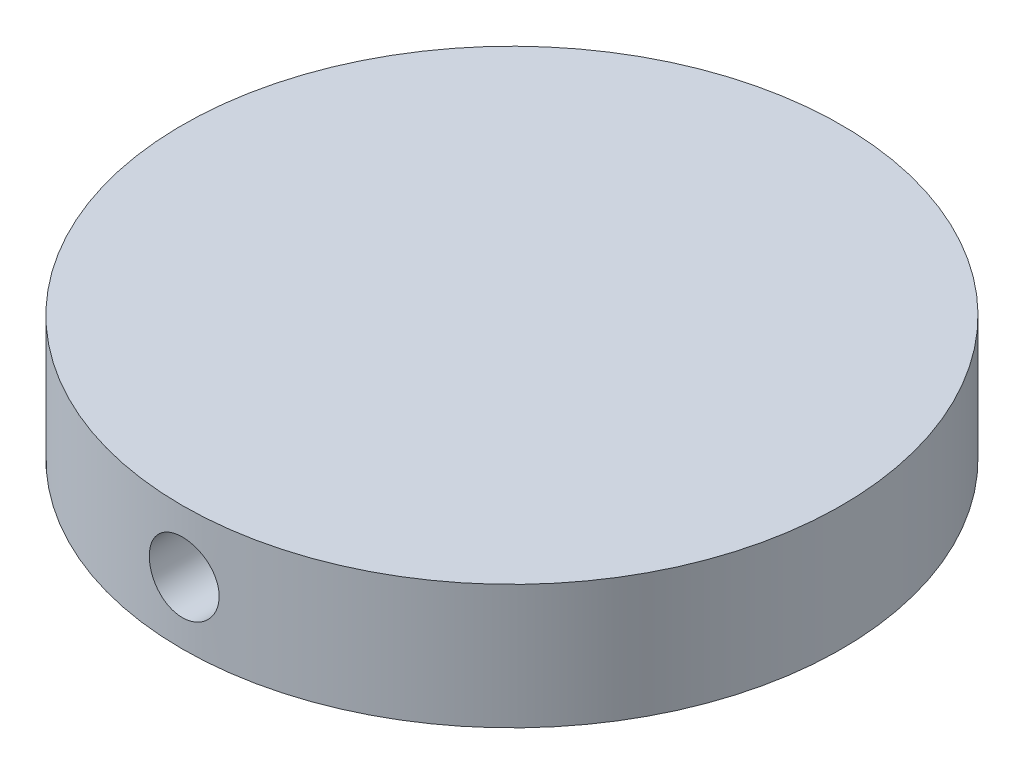
ISO-10303-21;
HEADER;
FILE_DESCRIPTION(('STEP AP214'),'2;1');
FILE_NAME('part.step','',(''),(''),'','','');
FILE_SCHEMA(('AUTOMOTIVE_DESIGN { 1 0 10303 214 1 1 1 1 }'));
ENDSEC;
DATA;
#1=APPLICATION_CONTEXT('core data for automotive mechanical design processes');
#2=APPLICATION_PROTOCOL_DEFINITION('international standard','automotive_design',2000,#1);
#3=PRODUCT_CONTEXT('',#1,'mechanical');
#4=PRODUCT('Part','Part','',(#3));
#5=PRODUCT_RELATED_PRODUCT_CATEGORY('part','',(#4));
#6=PRODUCT_DEFINITION_FORMATION('','',#4);
#7=PRODUCT_DEFINITION_CONTEXT('part definition',#1,'design');
#8=PRODUCT_DEFINITION('design','',#6,#7);
#9=PRODUCT_DEFINITION_SHAPE('','',#8);
#10=(LENGTH_UNIT() NAMED_UNIT(*) SI_UNIT(.MILLI.,.METRE.));
#11=(NAMED_UNIT(*) PLANE_ANGLE_UNIT() SI_UNIT($,.RADIAN.));
#12=(NAMED_UNIT(*) SI_UNIT($,.STERADIAN.) SOLID_ANGLE_UNIT());
#13=UNCERTAINTY_MEASURE_WITH_UNIT(LENGTH_MEASURE(1.E-05),#10,'distance_accuracy_value','');
#14=(GEOMETRIC_REPRESENTATION_CONTEXT(3) GLOBAL_UNCERTAINTY_ASSIGNED_CONTEXT((#13)) GLOBAL_UNIT_ASSIGNED_CONTEXT((#10,
#11,#12)) REPRESENTATION_CONTEXT('',''));
#15=CARTESIAN_POINT('',(0.,0.,0.));
#16=DIRECTION('',(0.,0.,1.));
#17=DIRECTION('',(1.,0.,0.));
#18=AXIS2_PLACEMENT_3D('',#15,#16,#17);
#19=CARTESIAN_POINT('',(0.,10.16,0.));
#20=DIRECTION('',(0.,-1.,0.));
#21=DIRECTION('',(0.,0.,-1.));
#22=AXIS2_PLACEMENT_3D('',#19,#20,#21);
#23=CYLINDRICAL_SURFACE('',#22,26.9426943892076);
#24=CARTESIAN_POINT('',(0.,7.93484678348048,-26.9426943892076));
#25=CARTESIAN_POINT('',(-0.159877159383876,7.93483988643036,-26.9426924517004));
#26=CARTESIAN_POINT('',(-0.319858758329828,7.92137138815957,-26.9412562283668));
#27=CARTESIAN_POINT('',(-0.635383052913121,7.86784825567092,-26.935664962776));
#28=CARTESIAN_POINT('',(-0.790920721198874,7.82776466481908,-26.931506959352));
#29=CARTESIAN_POINT('',(-1.09294263287596,7.72219447357253,-26.9209412920244));
#30=CARTESIAN_POINT('',(-1.23943241672469,7.65672360146154,-26.9145350212319));
#31=CARTESIAN_POINT('',(-1.51931297800012,7.5022687444642,-26.9001883139086));
#32=CARTESIAN_POINT('',(-1.65270627477424,7.41328929408403,-26.8922481733212));
#33=CARTESIAN_POINT('',(-1.90317412259161,7.2139599202933,-26.8756868697374));
#34=CARTESIAN_POINT('',(-2.02018862977533,7.10353473526227,-26.8670633735842));
#35=CARTESIAN_POINT('',(-2.23406095927334,6.86460930912446,-26.8501264660232));
#36=CARTESIAN_POINT('',(-2.33091782946652,6.73610821470463,-26.8418130692779));
#37=CARTESIAN_POINT('',(-2.5019408490585,6.46429928462084,-26.8264140392329));
#38=CARTESIAN_POINT('',(-2.57605219614729,6.32095678368136,-26.819331388773));
#39=CARTESIAN_POINT('',(-2.69913049228707,6.02377391650471,-26.8072251987603));
#40=CARTESIAN_POINT('',(-2.7480981344032,5.86993383975684,-26.8022016024522));
#41=CARTESIAN_POINT('',(-2.81931989738946,5.5567379633049,-26.7948037259853));
#42=CARTESIAN_POINT('',(-2.84167407108998,5.39740515422929,-26.7924195254556));
#43=CARTESIAN_POINT('',(-2.85934369682739,5.07723279416105,-26.7905397084476));
#44=CARTESIAN_POINT('',(-2.85465994146592,4.9163932874744,-26.7910440072944));
#45=CARTESIAN_POINT('',(-2.81846905343392,4.59846451776627,-26.794875143979));
#46=CARTESIAN_POINT('',(-2.78707137409505,4.44136263695995,-26.7981904641992));
#47=CARTESIAN_POINT('',(-2.6985143121884,4.13467072605792,-26.8072521094579));
#48=CARTESIAN_POINT('',(-2.64135454327105,3.98508080865519,-26.8129984709541));
#49=CARTESIAN_POINT('',(-2.50277573804035,3.69731462599618,-26.8262879464804));
#50=CARTESIAN_POINT('',(-2.42130835947024,3.55916181257801,-26.8338346348949));
#51=CARTESIAN_POINT('',(-2.23646159610886,3.29844819385414,-26.84987148588));
#52=CARTESIAN_POINT('',(-2.13308149091401,3.17588790138075,-26.8583616794649));
#53=CARTESIAN_POINT('',(-1.90673356485588,2.94920248878122,-26.8753802163619));
#54=CARTESIAN_POINT('',(-1.78367125697851,2.84517169024334,-26.8839085403335));
#55=CARTESIAN_POINT('',(-1.5217797010617,2.65923011053586,-26.9000027880204));
#56=CARTESIAN_POINT('',(-1.3829504318825,2.57731935902451,-26.9075687104454));
#57=CARTESIAN_POINT('',(-1.09339884192997,2.43794596333726,-26.9208886152643));
#58=CARTESIAN_POINT('',(-0.942674081742448,2.38048834930217,-26.9266422247925));
#59=CARTESIAN_POINT('',(-0.633641927096003,2.29172261785325,-26.9356855344664));
#60=CARTESIAN_POINT('',(-0.475334787509801,2.26041362213585,-26.9389753173689));
#61=CARTESIAN_POINT('',(-0.156448178430623,2.2249540984177,-26.9427096481539));
#62=CARTESIAN_POINT('',(0.0041166703529047,2.22067346311087,-26.9431678263981));
#63=CARTESIAN_POINT('',(0.323677590728516,2.23905009174925,-26.941223927833));
#64=CARTESIAN_POINT('',(0.482673686128314,2.26170694624974,-26.9388218944983));
#65=CARTESIAN_POINT('',(0.794206426753189,2.33320743550273,-26.9314361431082));
#66=CARTESIAN_POINT('',(0.946757264920026,2.38198990632225,-26.9264584559561));
#67=CARTESIAN_POINT('',(1.24151092739237,2.50429385679205,-26.9144795571014));
#68=CARTESIAN_POINT('',(1.38371349281771,2.57781595508887,-26.9074782947972));
#69=CARTESIAN_POINT('',(1.65432069634103,2.74783307987966,-26.8922008169085));
#70=CARTESIAN_POINT('',(1.78267153947844,2.84441330090572,-26.8839199143451));
#71=CARTESIAN_POINT('',(2.02138674359008,3.05768331741806,-26.8670267228596));
#72=CARTESIAN_POINT('',(2.13175059638013,3.17437368088214,-26.8584144245829));
#73=CARTESIAN_POINT('',(2.3318129132522,3.4251204794829,-26.8417878562375));
#74=CARTESIAN_POINT('',(2.42142579706549,3.55924539047159,-26.8337761517756));
#75=CARTESIAN_POINT('',(2.57685344767387,3.84071743219922,-26.8192976503929));
#76=CARTESIAN_POINT('',(2.64266857413196,3.98806436306761,-26.8128308301243));
#77=CARTESIAN_POINT('',(2.74849021362492,4.29150811747201,-26.8021906718622));
#78=CARTESIAN_POINT('',(2.7885470613092,4.44758722422036,-26.7980128632553));
#79=CARTESIAN_POINT('',(2.841878144485,4.7643027448899,-26.792410123055));
#80=CARTESIAN_POINT('',(2.85515325118819,4.92493901039403,-26.7909851019133));
#81=CARTESIAN_POINT('',(2.85453108497236,5.24535822720242,-26.791051333817));
#82=CARTESIAN_POINT('',(2.84076824523251,5.40514145945294,-26.7925281588352));
#83=CARTESIAN_POINT('',(2.78674334556824,5.72011183580245,-26.7982008634174));
#84=CARTESIAN_POINT('',(2.74648126091114,5.87529897561162,-26.8023967455192));
#85=CARTESIAN_POINT('',(2.64063897718774,6.17666724216665,-26.813030692379));
#86=CARTESIAN_POINT('',(2.57506329208913,6.32284996920978,-26.8194683573582));
#87=CARTESIAN_POINT('',(2.42046889655287,6.60215613943396,-26.8338612876177));
#88=CARTESIAN_POINT('',(2.33145022344948,6.73527960341214,-26.8418165504812));
#89=CARTESIAN_POINT('',(2.13199292023992,6.98537715048829,-26.8583957308812));
#90=CARTESIAN_POINT('',(2.02145404173616,7.10227108687087,-26.867022659795));
#91=CARTESIAN_POINT('',(1.78229603411016,7.31590763047929,-26.883945788664));
#92=CARTESIAN_POINT('',(1.65367259667136,7.41264542220147,-26.8922419092039));
#93=CARTESIAN_POINT('',(1.38159859335583,7.5834407726981,-26.9075931525462));
#94=CARTESIAN_POINT('',(1.23810765795318,7.65743429557786,-26.9146447481081));
#95=CARTESIAN_POINT('',(0.940751967813219,7.78017609682314,-26.9266748377104));
#96=CARTESIAN_POINT('',(0.786899036468111,7.82895261500818,-26.9316556495336));
#97=CARTESIAN_POINT('',(0.526825651007194,7.88781883613497,-26.9377424666804));
#98=CARTESIAN_POINT('',(0.422263189413774,7.90542995162689,-26.9395906945645));
#99=CARTESIAN_POINT('',(0.211815764247985,7.92894618228599,-26.9420672947914));
#100=CARTESIAN_POINT('',(0.105930806987645,7.93485135330201,-26.9426956729539));
#101=CARTESIAN_POINT('',(0.,7.93484678348048,-26.9426943892076));
#102=B_SPLINE_CURVE_WITH_KNOTS('',3,(#24,#25,#26,#27,#28,#29,#30,#31,#32,#33,#34,#35,#36,#37,
#38,#39,#40,#41,#42,#43,#44,#45,#46,#47,#48,#49,#50,#51,#52,#53,#54,#55,#56,#57,#58,#59,#60,#61,
#62,#63,#64,#65,#66,#67,#68,#69,#70,#71,#72,#73,#74,#75,#76,#77,#78,#79,#80,#81,#82,#83,#84,#85,
#86,#87,#88,#89,#90,#91,#92,#93,#94,#95,#96,#97,#98,#99,#100,#101),.UNSPECIFIED.,.T.,.F.,(4,2,2,
2,2,2,2,2,2,2,2,2,2,2,2,2,2,2,2,2,2,2,2,2,2,2,2,2,2,2,2,2,2,2,2,2,2,2,4),(0.,0.479244634675585,
0.959011533173834,1.43848167343976,1.91785939743963,2.39895088275477,2.88006508667779,
3.36232953237574,3.84458068414511,4.32501303830536,4.80543130893376,5.28389061793137,
5.76235710253872,6.24178156266498,6.7212217868121,7.20303681270819,7.68485248461164,
8.16676722071906,8.64866576918507,9.12824280698233,9.60781255539319,10.0862644369199,
10.564728283647,11.0449880760369,11.5252614347958,12.0074815758749,12.4896944287048,
12.9709620952267,13.4522141058297,13.9310793776005,14.4099450963137,14.8887254622305,
15.3675050656676,15.8485707901386,16.32975131455,16.8122744368203,17.2942560179899,
17.6117936406273,17.9293297482947),.UNSPECIFIED.);
#103=CARTESIAN_POINT('',(0.,7.93484678348048,-26.9426943892076));
#104=VERTEX_POINT('',#103);
#105=EDGE_CURVE('E10',#104,#104,#102,.T.);
#106=ORIENTED_EDGE('',*,*,#105,.T.);
#107=EDGE_LOOP('',(#106));
#108=FACE_BOUND('',#107,.T.);
#109=CARTESIAN_POINT('',(2.85484678348048,5.08,26.7910177259673));
#110=CARTESIAN_POINT('',(2.85483988389814,4.92012568123884,26.7910197041622));
#111=CARTESIAN_POINT('',(2.84137184805784,4.7601469141133,26.7924642195504));
#112=CARTESIAN_POINT('',(2.78785071932311,4.44462850317713,26.7980851061099));
#113=CARTESIAN_POINT('',(2.74776865992525,4.28909388894578,26.8022644537802));
#114=CARTESIAN_POINT('',(2.64220294850322,3.98707843559701,26.8128764103614));
#115=CARTESIAN_POINT('',(2.57673509753405,3.84059203016363,26.8193076173908));
#116=CARTESIAN_POINT('',(2.42228735550066,3.5607171314871,26.8336969427398));
#117=CARTESIAN_POINT('',(2.33331199154483,3.42732612309169,26.8416547669807));
#118=CARTESIAN_POINT('',(2.13398674884937,3.17685569884867,26.8582369059445));
#119=CARTESIAN_POINT('',(2.02356069523453,3.05983704988936,26.8668635280554));
#120=CARTESIAN_POINT('',(1.7846317918789,2.84595672452549,26.8837903637851));
#121=CARTESIAN_POINT('',(1.65612810013852,2.74909598753442,26.892090562177));
#122=CARTESIAN_POINT('',(1.38431688681535,2.57806891842799,26.90745235457));
#123=CARTESIAN_POINT('',(1.24097514665537,2.50395668010404,26.9145109794833));
#124=CARTESIAN_POINT('',(0.943793932793908,2.38087652649759,26.9265691348402));
#125=CARTESIAN_POINT('',(0.789954744190559,2.33190792865161,26.9315687211789));
#126=CARTESIAN_POINT('',(0.476761617403015,2.26068417744013,26.9389292708106));
#127=CARTESIAN_POINT('',(0.31743068818355,2.23832888465075,26.9413001230663));
#128=CARTESIAN_POINT('',(-0.00273798890655452,2.22065636938549,26.9431697389119));
#129=CARTESIAN_POINT('',(-0.163575693150743,2.22533836648543,26.9426685854014));
#130=CARTESIAN_POINT('',(-0.481512201908553,2.26152646514839,26.9388587290631));
#131=CARTESIAN_POINT('',(-0.638623417067487,2.2929248835038,26.9355612970948));
#132=CARTESIAN_POINT('',(-0.94533361490643,2.38148665676935,26.9265423001963));
#133=CARTESIAN_POINT('',(-1.094932489791,2.43865038127151,26.9208207004925));
#134=CARTESIAN_POINT('',(-1.38270955267683,2.57723738834138,26.9075771382247));
#135=CARTESIAN_POINT('',(-1.52086473540974,2.65870809216498,26.9000516621152));
#136=CARTESIAN_POINT('',(-1.78158168363497,2.84356195880917,26.8840442349329));
#137=CARTESIAN_POINT('',(-1.90414293510587,2.94694584365277,26.8755622523482));
#138=CARTESIAN_POINT('',(-2.13082409941682,3.17329645755509,26.8585439133967));
#139=CARTESIAN_POINT('',(-2.23485045320336,3.29635690020434,26.8500074946236));
#140=CARTESIAN_POINT('',(-2.42078395275651,3.55824313812095,26.833883870498));
#141=CARTESIAN_POINT('',(-2.5026910596202,3.69706896111557,26.8262966668151));
#142=CARTESIAN_POINT('',(-2.642061830764,3.98661960319734,26.8129300381883));
#143=CARTESIAN_POINT('',(-2.69951934188553,4.13734740631932,26.8071510684142));
#144=CARTESIAN_POINT('',(-2.78828393568845,4.4463861773084,26.7980645269877));
#145=CARTESIAN_POINT('',(-2.81959191522391,4.60469688490665,26.7947568705767));
#146=CARTESIAN_POINT('',(-2.85504760440086,4.92358517635758,26.7910023390565));
#147=CARTESIAN_POINT('',(-2.85932637241224,5.08414803243837,26.7905416598524));
#148=CARTESIAN_POINT('',(-2.84094672042313,5.40370451934607,26.7924967993199));
#149=CARTESIAN_POINT('',(-2.81828870996806,5.56269817399397,26.7949125742582));
#150=CARTESIAN_POINT('',(-2.74678848347511,5.87421865848104,26.8023358598888));
#151=CARTESIAN_POINT('',(-2.69800856223978,6.02675994575399,26.8073372036112));
#152=CARTESIAN_POINT('',(-2.57571290813547,6.3214956338309,26.8193631021633));
#153=CARTESIAN_POINT('',(-2.50219654155663,6.46368976944317,26.8263877088251));
#154=CARTESIAN_POINT('',(-2.33218787464845,6.73429119102948,26.8417019815438));
#155=CARTESIAN_POINT('',(-2.2356089241447,6.86264376621816,26.8499963751835));
#156=CARTESIAN_POINT('',(-2.02234043224916,7.10136305646955,26.8669003249733));
#157=CARTESIAN_POINT('',(-1.90565033137473,7.21172927099401,26.8755098898861));
#158=CARTESIAN_POINT('',(-1.65490250976746,7.4117967460015,26.8921159390344));
#159=CARTESIAN_POINT('',(-1.52077626495283,7.50141237286178,26.9001097949485));
#160=CARTESIAN_POINT('',(-1.23930081892112,7.65684483537649,26.9145452564537));
#161=CARTESIAN_POINT('',(-1.09195181810536,7.72266203163899,26.9209868855647));
#162=CARTESIAN_POINT('',(-0.788509326048759,7.82848502808786,26.9315802756683));
#163=CARTESIAN_POINT('',(-0.632433866442129,7.86854205984484,26.9357365792914));
#164=CARTESIAN_POINT('',(-0.315726042104914,7.92187474679885,26.9413097075169));
#165=CARTESIAN_POINT('',(-0.155093822453134,7.93515125366994,26.9427266192374));
#166=CARTESIAN_POINT('',(0.165327754631512,7.93453319493961,26.9426611928439));
#167=CARTESIAN_POINT('',(0.325117387508638,7.92077136746343,26.9411930183525));
#168=CARTESIAN_POINT('',(0.640100819195297,7.86674624175336,26.9355503651846));
#169=CARTESIAN_POINT('',(0.795294615670551,7.82648293005929,26.9313758851336));
#170=CARTESIAN_POINT('',(1.09667630769143,7.72063565542683,26.9207881365634));
#171=CARTESIAN_POINT('',(1.2428657776629,7.65505613373928,26.9143752607473));
#172=CARTESIAN_POINT('',(1.52218383439756,7.50045197569658,26.9000245264412));
#173=CARTESIAN_POINT('',(1.6553124461425,7.41142738418645,26.8920866708681));
#174=CARTESIAN_POINT('',(1.90540975951221,7.21196354366497,26.8755279478503));
#175=CARTESIAN_POINT('',(2.02229939054917,7.10142540173502,26.8669040393715));
#176=CARTESIAN_POINT('',(2.23592759154584,6.86227064255722,26.849970653667));
#177=CARTESIAN_POINT('',(2.33266133468214,6.73364970726131,26.8416612521466));
#178=CARTESIAN_POINT('',(2.50345229560147,6.46157777047998,26.8262726465109));
#179=CARTESIAN_POINT('',(2.57744475870302,6.31808594820719,26.8191969797005));
#180=CARTESIAN_POINT('',(2.70018433345021,6.02072838269013,26.8071189004901));
#181=CARTESIAN_POINT('',(2.74895969891465,5.86687446887208,26.8021141690273));
#182=CARTESIAN_POINT('',(2.80782269420793,5.60680416318025,26.7959965743665));
#183=CARTESIAN_POINT('',(2.82543235764204,5.50224599161965,26.7941384365621));
#184=CARTESIAN_POINT('',(2.8489466594886,5.29180715957857,26.7916483600093));
#185=CARTESIAN_POINT('',(2.85485135487539,5.18592650553783,26.7910164152923));
#186=CARTESIAN_POINT('',(2.85484678348048,5.08,26.7910177259673));
#187=B_SPLINE_CURVE_WITH_KNOTS('',3,(#109,#110,#111,#112,#113,#114,#115,#116,#117,#118,#119,
#120,#121,#122,#123,#124,#125,#126,#127,#128,#129,#130,#131,#132,#133,#134,#135,#136,#137,#138,
#139,#140,#141,#142,#143,#144,#145,#146,#147,#148,#149,#150,#151,#152,#153,#154,#155,#156,#157,
#158,#159,#160,#161,#162,#163,#164,#165,#166,#167,#168,#169,#170,#171,#172,#173,#174,#175,#176,
#177,#178,#179,#180,#181,#182,#183,#184,#185,#186),.UNSPECIFIED.,.T.,.F.,(4,2,2,2,2,2,2,2,2,2,2,
2,2,2,2,2,2,2,2,2,2,2,2,2,2,2,2,2,2,2,2,2,2,2,2,2,2,2,4),(0.,0.479236101843129,
0.958994657527075,1.43845507186457,1.91782321829214,2.39892587039877,2.8800509381789,
3.36231136802521,3.84455870546524,4.32498566896762,4.80539876514303,5.28388463107909,
5.76237736090327,6.24180977044283,6.7212579793796,7.20306167895704,7.68486622591645,
8.16679195561281,8.64870115595771,9.12827188541983,9.60783532360617,10.086260172384,
10.5646972786072,11.0449610516514,11.525238187563,12.0074633480216,12.48968120121,
12.9709370337541,13.4521775611623,13.9310614579421,14.4099455979485,14.888745764928,
15.3675450160797,15.8485995236835,16.3297690995624,16.8122963530261,17.2942817937403,
17.6118065412139,17.9293297431213),.UNSPECIFIED.);
#188=CARTESIAN_POINT('',(2.85484678348048,5.08,26.7910177259673));
#189=VERTEX_POINT('',#188);
#190=EDGE_CURVE('E41',#189,#189,#187,.T.);
#191=ORIENTED_EDGE('',*,*,#190,.T.);
#192=EDGE_LOOP('',(#191));
#193=FACE_BOUND('',#192,.T.);
#194=CARTESIAN_POINT('',(0.,10.16,0.));
#195=DIRECTION('',(0.,1.,0.));
#196=DIRECTION('',(0.,0.,1.));
#197=AXIS2_PLACEMENT_3D('',#194,#195,#196);
#198=CIRCLE('',#197,26.9426943892076);
#199=CARTESIAN_POINT('',(0.,10.16,26.9426943892076));
#200=VERTEX_POINT('',#199);
#201=EDGE_CURVE('E45',#200,#200,#198,.T.);
#202=ORIENTED_EDGE('',*,*,#201,.F.);
#203=EDGE_LOOP('',(#202));
#204=FACE_BOUND('',#203,.T.);
#205=CARTESIAN_POINT('',(0.,0.,0.));
#206=DIRECTION('',(0.,1.,0.));
#207=DIRECTION('',(0.,0.,1.));
#208=AXIS2_PLACEMENT_3D('',#205,#206,#207);
#209=CIRCLE('',#208,26.9426943892076);
#210=CARTESIAN_POINT('',(0.,0.,26.9426943892076));
#211=VERTEX_POINT('',#210);
#212=EDGE_CURVE('E49',#211,#211,#209,.T.);
#213=ORIENTED_EDGE('',*,*,#212,.T.);
#214=EDGE_LOOP('',(#213));
#215=FACE_BOUND('',#214,.T.);
#216=ADVANCED_FACE('F31',(#108,#193,#204,#215),#23,.T.);
#217=CARTESIAN_POINT('',(0.,10.16,0.));
#218=DIRECTION('',(0.,1.,0.));
#219=DIRECTION('',(0.,0.,1.));
#220=AXIS2_PLACEMENT_3D('',#217,#218,#219);
#221=PLANE('',#220);
#222=ORIENTED_EDGE('',*,*,#201,.T.);
#223=EDGE_LOOP('',(#222));
#224=FACE_BOUND('',#223,.T.);
#225=ADVANCED_FACE('F60',(#224),#221,.T.);
#226=CARTESIAN_POINT('',(0.,0.,0.));
#227=DIRECTION('',(0.,1.,0.));
#228=DIRECTION('',(0.,0.,1.));
#229=AXIS2_PLACEMENT_3D('',#226,#227,#228);
#230=PLANE('',#229);
#231=ORIENTED_EDGE('',*,*,#212,.F.);
#232=EDGE_LOOP('',(#231));
#233=FACE_BOUND('',#232,.T.);
#234=ADVANCED_FACE('F58',(#233),#230,.F.);
#235=CARTESIAN_POINT('',(0.,5.08,-26.9426943892076));
#236=DIRECTION('',(0.,0.,1.));
#237=DIRECTION('',(1.,0.,0.));
#238=AXIS2_PLACEMENT_3D('',#235,#236,#237);
#239=CYLINDRICAL_SURFACE('',#238,2.85484678348048);
#240=ORIENTED_EDGE('',*,*,#190,.F.);
#241=EDGE_LOOP('',(#240));
#242=FACE_BOUND('',#241,.T.);
#243=ORIENTED_EDGE('',*,*,#105,.F.);
#244=EDGE_LOOP('',(#243));
#245=FACE_BOUND('',#244,.T.);
#246=ADVANCED_FACE('F54',(#242,#245),#239,.F.);
#247=CLOSED_SHELL('',(#216,#225,#234,#246));
#248=MANIFOLD_SOLID_BREP('B2',#247);
#249=ADVANCED_BREP_SHAPE_REPRESENTATION('',(#18,#248),#14);
#250=SHAPE_DEFINITION_REPRESENTATION(#9,#249);
ENDSEC;
END-ISO-10303-21;
